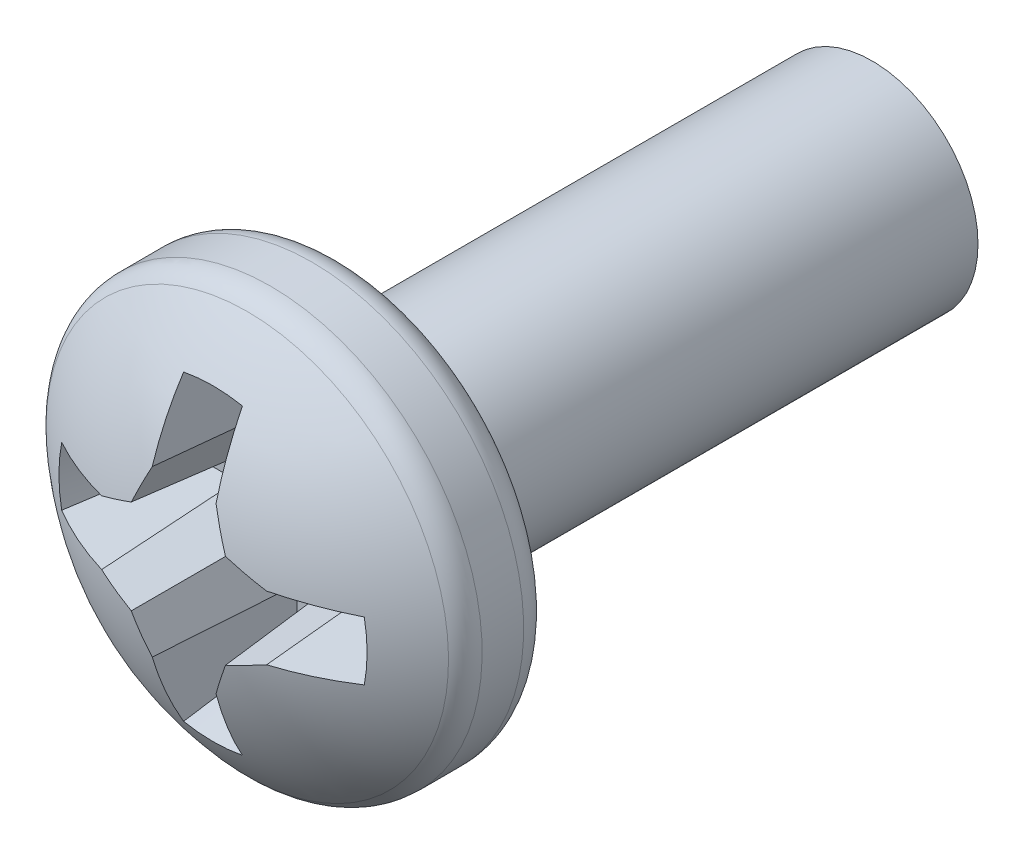
ISO-10303-21;
HEADER;
FILE_DESCRIPTION(('STEP AP214'),'2;1');
FILE_NAME('part.step','',(''),(''),'','','');
FILE_SCHEMA(('AUTOMOTIVE_DESIGN { 1 0 10303 214 1 1 1 1 }'));
ENDSEC;
DATA;
#1=APPLICATION_CONTEXT('core data for automotive mechanical design processes');
#2=APPLICATION_PROTOCOL_DEFINITION('international standard','automotive_design',2000,#1);
#3=PRODUCT_CONTEXT('',#1,'mechanical');
#4=PRODUCT('Part','Part','',(#3));
#5=PRODUCT_RELATED_PRODUCT_CATEGORY('part','',(#4));
#6=PRODUCT_DEFINITION_FORMATION('','',#4);
#7=PRODUCT_DEFINITION_CONTEXT('part definition',#1,'design');
#8=PRODUCT_DEFINITION('design','',#6,#7);
#9=PRODUCT_DEFINITION_SHAPE('','',#8);
#10=(LENGTH_UNIT() NAMED_UNIT(*) SI_UNIT(.MILLI.,.METRE.));
#11=(NAMED_UNIT(*) PLANE_ANGLE_UNIT() SI_UNIT($,.RADIAN.));
#12=(NAMED_UNIT(*) SI_UNIT($,.STERADIAN.) SOLID_ANGLE_UNIT());
#13=UNCERTAINTY_MEASURE_WITH_UNIT(LENGTH_MEASURE(1.E-05),#10,'distance_accuracy_value','');
#14=(GEOMETRIC_REPRESENTATION_CONTEXT(3) GLOBAL_UNCERTAINTY_ASSIGNED_CONTEXT((#13)) GLOBAL_UNIT_ASSIGNED_CONTEXT((#10,
#11,#12)) REPRESENTATION_CONTEXT('',''));
#15=CARTESIAN_POINT('',(0.,0.,0.));
#16=DIRECTION('',(0.,0.,1.));
#17=DIRECTION('',(1.,0.,0.));
#18=AXIS2_PLACEMENT_3D('',#15,#16,#17);
#19=CARTESIAN_POINT('',(0.,0.,3.195));
#20=DIRECTION('',(0.,0.,1.));
#21=DIRECTION('',(1.,0.,0.));
#22=AXIS2_PLACEMENT_3D('',#19,#20,#21);
#23=PLANE('',#22);
#24=DIRECTION('',(0.,1.,0.));
#25=VECTOR('',#24,1.);
#26=CARTESIAN_POINT('',(0.153325026803848,0.,3.195));
#27=LINE('',#26,#25);
#28=CARTESIAN_POINT('',(0.153325026803848,0.941513378983801,3.19499999997416));
#29=VERTEX_POINT('',#28);
#30=CARTESIAN_POINT('',(0.153325026803873,0.605770152215096,3.195));
#31=VERTEX_POINT('',#30);
#32=EDGE_CURVE('E369',#29,#31,#27,.F.);
#33=ORIENTED_EDGE('',*,*,#32,.F.);
#34=CARTESIAN_POINT('',(0.,0.,3.19499999994832));
#35=DIRECTION('',(0.,0.,1.));
#36=DIRECTION('',(1.,0.,0.));
#37=AXIS2_PLACEMENT_3D('',#34,#35,#36);
#38=CIRCLE('',#37,0.953916142350408);
#39=CARTESIAN_POINT('',(-0.153325026801598,0.941513378984166,3.19499999997416));
#40=VERTEX_POINT('',#39);
#41=EDGE_CURVE('E329',#29,#40,#38,.T.);
#42=ORIENTED_EDGE('',*,*,#41,.T.);
#43=DIRECTION('',(0.,1.,0.));
#44=VECTOR('',#43,1.);
#45=CARTESIAN_POINT('',(-0.153325026803858,0.,3.19499999999999));
#46=LINE('',#45,#44);
#47=CARTESIAN_POINT('',(-0.153325026803853,0.605770152215198,3.195));
#48=VERTEX_POINT('',#47);
#49=EDGE_CURVE('E391',#48,#40,#46,.T.);
#50=ORIENTED_EDGE('',*,*,#49,.F.);
#51=DIRECTION('',(0.382683432365053,0.923879532511302,0.));
#52=VECTOR('',#51,1.);
#53=CARTESIAN_POINT('',(-0.345043187727096,0.142921567960997,3.195));
#54=LINE('',#53,#52);
#55=CARTESIAN_POINT('',(-0.285843135922024,0.285843135922012,3.195));
#56=VERTEX_POINT('',#55);
#57=EDGE_CURVE('E400',#56,#48,#54,.T.);
#58=ORIENTED_EDGE('',*,*,#57,.F.);
#59=DIRECTION('',(0.923879532511302,0.382683432365053,0.));
#60=VECTOR('',#59,1.);
#61=CARTESIAN_POINT('',(-0.142921567960997,0.345043187727096,3.195));
#62=LINE('',#61,#60);
#63=CARTESIAN_POINT('',(-0.605770152215094,0.153325026803873,3.195));
#64=VERTEX_POINT('',#63);
#65=EDGE_CURVE('E406',#64,#56,#62,.T.);
#66=ORIENTED_EDGE('',*,*,#65,.F.);
#67=DIRECTION('',(1.,0.,0.));
#68=VECTOR('',#67,1.);
#69=CARTESIAN_POINT('',(0.,0.153325026803848,3.195));
#70=LINE('',#69,#68);
#71=CARTESIAN_POINT('',(-0.941513378984152,0.153325026801587,3.19499999997416));
#72=VERTEX_POINT('',#71);
#73=EDGE_CURVE('E411',#72,#64,#70,.T.);
#74=ORIENTED_EDGE('',*,*,#73,.F.);
#75=CARTESIAN_POINT('',(0.,0.,3.19499999994832));
#76=DIRECTION('',(0.,0.,1.));
#77=DIRECTION('',(1.,0.,0.));
#78=AXIS2_PLACEMENT_3D('',#75,#76,#77);
#79=CIRCLE('',#78,0.953916142350408);
#80=CARTESIAN_POINT('',(-0.941513378984149,-0.153325026801598,3.19499999997416));
#81=VERTEX_POINT('',#80);
#82=EDGE_CURVE('E414',#72,#81,#79,.T.);
#83=ORIENTED_EDGE('',*,*,#82,.T.);
#84=DIRECTION('',(1.,0.,0.));
#85=VECTOR('',#84,1.);
#86=CARTESIAN_POINT('',(0.,-0.153325026803858,3.19499999999999));
#87=LINE('',#86,#85);
#88=CARTESIAN_POINT('',(-0.605770152215199,-0.153325026803857,3.19499999999999));
#89=VERTEX_POINT('',#88);
#90=EDGE_CURVE('E417',#89,#81,#87,.F.);
#91=ORIENTED_EDGE('',*,*,#90,.F.);
#92=DIRECTION('',(-0.923879532511302,0.382683432365053,0.));
#93=VECTOR('',#92,1.);
#94=CARTESIAN_POINT('',(-0.142921567961001,-0.345043187727106,3.195));
#95=LINE('',#94,#93);
#96=CARTESIAN_POINT('',(-0.28584313592201,-0.285843135922032,3.195));
#97=VERTEX_POINT('',#96);
#98=EDGE_CURVE('E423',#97,#89,#95,.T.);
#99=ORIENTED_EDGE('',*,*,#98,.F.);
#100=DIRECTION('',(-0.382683432365138,0.923879532511267,0.));
#101=VECTOR('',#100,1.);
#102=CARTESIAN_POINT('',(-0.345043187727103,-0.14292156796099,3.195));
#103=LINE('',#102,#101);
#104=CARTESIAN_POINT('',(-0.153325026803813,-0.605770152215198,3.195));
#105=VERTEX_POINT('',#104);
#106=EDGE_CURVE('E429',#105,#97,#103,.T.);
#107=ORIENTED_EDGE('',*,*,#106,.F.);
#108=DIRECTION('',(0.,1.,0.));
#109=VECTOR('',#108,1.);
#110=CARTESIAN_POINT('',(-0.153325026803847,0.,3.195));
#111=LINE('',#110,#109);
#112=CARTESIAN_POINT('',(-0.153325026801587,-0.941513378984138,3.19499999997416));
#113=VERTEX_POINT('',#112);
#114=EDGE_CURVE('E435',#113,#105,#111,.T.);
#115=ORIENTED_EDGE('',*,*,#114,.F.);
#116=CARTESIAN_POINT('',(0.,0.,3.19499999994832));
#117=DIRECTION('',(0.,0.,1.));
#118=DIRECTION('',(1.,0.,0.));
#119=AXIS2_PLACEMENT_3D('',#116,#117,#118);
#120=CIRCLE('',#119,0.953916142350408);
#121=CARTESIAN_POINT('',(0.153325026801607,-0.941513378984134,3.19499999997416));
#122=VERTEX_POINT('',#121);
#123=EDGE_CURVE('E438',#113,#122,#120,.T.);
#124=ORIENTED_EDGE('',*,*,#123,.T.);
#125=DIRECTION('',(0.,1.,0.));
#126=VECTOR('',#125,1.);
#127=CARTESIAN_POINT('',(0.153325026803858,0.,3.19499999999999));
#128=LINE('',#127,#126);
#129=CARTESIAN_POINT('',(0.153325026803861,-0.605770152215199,3.19499999999999));
#130=VERTEX_POINT('',#129);
#131=EDGE_CURVE('E441',#130,#122,#128,.F.);
#132=ORIENTED_EDGE('',*,*,#131,.F.);
#133=DIRECTION('',(-0.382683432365053,-0.923879532511302,0.));
#134=VECTOR('',#133,1.);
#135=CARTESIAN_POINT('',(0.345043187727106,-0.142921567961001,3.195));
#136=LINE('',#135,#134);
#137=CARTESIAN_POINT('',(0.285843135922033,-0.285843135922014,3.195));
#138=VERTEX_POINT('',#137);
#139=EDGE_CURVE('E447',#138,#130,#136,.T.);
#140=ORIENTED_EDGE('',*,*,#139,.F.);
#141=DIRECTION('',(-0.923879532511267,-0.382683432365138,0.));
#142=VECTOR('',#141,1.);
#143=CARTESIAN_POINT('',(0.142921567960994,-0.345043187727113,3.195));
#144=LINE('',#143,#142);
#145=CARTESIAN_POINT('',(0.605770152215202,-0.153325026803821,3.195));
#146=VERTEX_POINT('',#145);
#147=EDGE_CURVE('E453',#146,#138,#144,.T.);
#148=ORIENTED_EDGE('',*,*,#147,.F.);
#149=DIRECTION('',(1.,0.,0.));
#150=VECTOR('',#149,1.);
#151=CARTESIAN_POINT('',(0.,-0.153325026803858,3.19499999999999));
#152=LINE('',#151,#150);
#153=CARTESIAN_POINT('',(0.941513378984168,-0.153325026801587,3.19499999997416));
#154=VERTEX_POINT('',#153);
#155=EDGE_CURVE('E458',#154,#146,#152,.F.);
#156=ORIENTED_EDGE('',*,*,#155,.F.);
#157=CARTESIAN_POINT('',(0.,0.,3.19499999994832));
#158=DIRECTION('',(0.,0.,1.));
#159=DIRECTION('',(1.,0.,0.));
#160=AXIS2_PLACEMENT_3D('',#157,#158,#159);
#161=CIRCLE('',#160,0.953916142350408);
#162=CARTESIAN_POINT('',(0.941513378984169,0.153325026801587,3.19499999997416));
#163=VERTEX_POINT('',#162);
#164=EDGE_CURVE('E180',#154,#163,#161,.T.);
#165=ORIENTED_EDGE('',*,*,#164,.T.);
#166=DIRECTION('',(1.,0.,0.));
#167=VECTOR('',#166,1.);
#168=CARTESIAN_POINT('',(0.,0.153325026803848,3.195));
#169=LINE('',#168,#167);
#170=CARTESIAN_POINT('',(0.605770152215199,0.153325026803846,3.195));
#171=VERTEX_POINT('',#170);
#172=EDGE_CURVE('E179',#171,#163,#169,.T.);
#173=ORIENTED_EDGE('',*,*,#172,.F.);
#174=DIRECTION('',(0.923879532511302,-0.382683432365053,0.));
#175=VECTOR('',#174,1.);
#176=CARTESIAN_POINT('',(0.142921567960997,0.345043187727097,3.19500000000001));
#177=LINE('',#176,#175);
#178=CARTESIAN_POINT('',(0.285843135921985,0.285843135922043,3.195));
#179=VERTEX_POINT('',#178);
#180=EDGE_CURVE('E371',#179,#171,#177,.T.);
#181=ORIENTED_EDGE('',*,*,#180,.F.);
#182=DIRECTION('',(0.382683432365053,-0.923879532511302,0.));
#183=VECTOR('',#182,1.);
#184=CARTESIAN_POINT('',(0.345043187727096,0.142921567960997,3.195));
#185=LINE('',#184,#183);
#186=EDGE_CURVE('E372',#31,#179,#185,.T.);
#187=ORIENTED_EDGE('',*,*,#186,.F.);
#188=EDGE_LOOP('',(#33,#42,#50,#58,#66,#74,#83,#91,#99,#107,#115,#124,#132,#140,#148,#156,#165,
#173,#181,#187));
#189=FACE_BOUND('',#188,.T.);
#190=ADVANCED_FACE('F17',(#189),#23,.T.);
#191=CARTESIAN_POINT('',(0.25,0.,4.3));
#192=DIRECTION('',(-0.996194698091745,0.,0.0871557427476639));
#193=DIRECTION('',(0.0871557427476639,0.,0.996194698091745));
#194=AXIS2_PLACEMENT_3D('',#191,#192,#193);
#195=PLANE('',#194);
#196=CARTESIAN_POINT('',(0.222202804578549,1.14347686717482,3.98227660246275));
#197=CARTESIAN_POINT('',(0.226318021238147,1.06128462666399,4.02931374411915));
#198=CARTESIAN_POINT('',(0.229966578223961,0.976837793060016,4.0710169412966));
#199=CARTESIAN_POINT('',(0.236330372848018,0.803434939665801,4.14375544669361));
#200=CARTESIAN_POINT('',(0.239045610486262,0.714478919875557,4.17479075491317));
#201=CARTESIAN_POINT('',(0.241294188450721,0.623268306992177,4.20049211865377));
#202=B_SPLINE_CURVE_WITH_KNOTS('',3,(#196,#197,#198,#199,#200,#201),.UNSPECIFIED.,.F.,.F.,(4,2,
4),(0.,0.282760723859828,0.565521447719656),.UNSPECIFIED.);
#203=CARTESIAN_POINT('',(0.222202804578726,1.14347686717304,3.98227660246477));
#204=VERTEX_POINT('',#203);
#205=CARTESIAN_POINT('',(0.241294188356618,0.623268306665479,4.20049211875669));
#206=VERTEX_POINT('',#205);
#207=EDGE_CURVE('E328',#204,#206,#202,.T.);
#208=ORIENTED_EDGE('',*,*,#207,.F.);
#209=CARTESIAN_POINT('',(0.222202804578903,1.14347686717126,3.9822766024668));
#210=CARTESIAN_POINT('',(0.210721447943668,1.10989382736518,3.85104409561942));
#211=CARTESIAN_POINT('',(0.19924095486075,1.0762720169253,3.71982145922019));
#212=CARTESIAN_POINT('',(0.176281695601464,1.00895085419717,3.45739592505391));
#213=CARTESIAN_POINT('',(0.164802929425126,0.975251501907565,3.3261930272872));
#214=CARTESIAN_POINT('',(0.153325026801134,0.941513378982835,3.19499999996898));
#215=B_SPLINE_CURVE_WITH_KNOTS('',3,(#209,#210,#211,#212,#213,#214),.UNSPECIFIED.,.F.,.F.,(4,2,
4),(0.,0.407841235605517,0.815682478248343),.UNSPECIFIED.);
#216=EDGE_CURVE('E334',#204,#29,#215,.T.);
#217=ORIENTED_EDGE('',*,*,#216,.T.);
#218=ORIENTED_EDGE('',*,*,#32,.T.);
#219=DIRECTION('',(-0.0871426484044436,-0.017333750493863,-0.996045029063885));
#220=VECTOR('',#219,1.);
#221=CARTESIAN_POINT('',(0.241294188464864,0.623268306417485,4.200492118815));
#222=LINE('',#221,#220);
#223=EDGE_CURVE('E368',#206,#31,#222,.T.);
#224=ORIENTED_EDGE('',*,*,#223,.F.);
#225=EDGE_LOOP('',(#208,#217,#218,#224));
#226=FACE_BOUND('',#225,.T.);
#227=ADVANCED_FACE('F348',(#226),#195,.T.);
#228=CARTESIAN_POINT('',(0.4343592167691,0.1799174785275,4.3));
#229=DIRECTION('',(-0.920363891963239,-0.381227206369616,0.0871557427476637));
#230=DIRECTION('',(0.382683432365053,-0.923879532511302,0.));
#231=AXIS2_PLACEMENT_3D('',#228,#229,#230);
#232=PLANE('',#231);
#233=CARTESIAN_POINT('',(0.241294188248372,0.623268306913474,4.20049211869837));
#234=CARTESIAN_POINT('',(0.26049848856184,0.579277607891633,4.2108700152784));
#235=CARTESIAN_POINT('',(0.279666825906258,0.535017269048238,4.21968871392408));
#236=CARTESIAN_POINT('',(0.317931574656992,0.445957311718337,4.23420771534672));
#237=CARTESIAN_POINT('',(0.337027986063308,0.401157693231831,4.23990801812369));
#238=CARTESIAN_POINT('',(0.356088434500573,0.356088434923769,4.24404912296629));
#239=B_SPLINE_CURVE_WITH_KNOTS('',3,(#233,#234,#235,#236,#237,#238),.UNSPECIFIED.,.F.,.F.,(4,2,
4),(0.,0.147097076014323,0.294194152028647),.UNSPECIFIED.);
#240=CARTESIAN_POINT('',(0.356088434521289,0.356088434670804,4.24404912300344));
#241=VERTEX_POINT('',#240);
#242=EDGE_CURVE('E189',#206,#241,#239,.T.);
#243=ORIENTED_EDGE('',*,*,#242,.F.);
#244=ORIENTED_EDGE('',*,*,#223,.T.);
#245=ORIENTED_EDGE('',*,*,#186,.T.);
#246=DIRECTION('',(-0.0666626913468094,-0.0666626913468493,-0.995546167269401));
#247=VECTOR('',#246,1.);
#248=CARTESIAN_POINT('',(0.356088434626304,0.35608843462641,4.244049122994));
#249=LINE('',#248,#247);
#250=EDGE_CURVE('E375',#241,#179,#249,.T.);
#251=ORIENTED_EDGE('',*,*,#250,.F.);
#252=EDGE_LOOP('',(#243,#244,#245,#251));
#253=FACE_BOUND('',#252,.T.);
#254=ADVANCED_FACE('F351',(#253),#232,.T.);
#255=CARTESIAN_POINT('',(0.1799174785275,0.4343592167691,4.3));
#256=DIRECTION('',(-0.381227206369616,-0.920363891963239,0.0871557427476637));
#257=DIRECTION('',(0.923879532511302,-0.382683432365053,0.));
#258=AXIS2_PLACEMENT_3D('',#255,#256,#257);
#259=PLANE('',#258);
#260=CARTESIAN_POINT('',(0.356088434416274,0.356088434715197,4.24404912301289));
#261=CARTESIAN_POINT('',(0.401157692725597,0.33702798627853,4.23990801818212));
#262=CARTESIAN_POINT('',(0.445957311213714,0.317931574872662,4.23420771541694));
#263=CARTESIAN_POINT('',(0.535017268547538,0.279666826122526,4.21968871401776));
#264=CARTESIAN_POINT('',(0.579277607393245,0.260498488778257,4.21087001538376));
#265=CARTESIAN_POINT('',(0.623268306417746,0.241294188464789,4.20049211881536));
#266=B_SPLINE_CURVE_WITH_KNOTS('',3,(#260,#261,#262,#263,#264,#265),.UNSPECIFIED.,.F.,.F.,(4,2,
4),(0.,0.147097076014106,0.294194152028211),.UNSPECIFIED.);
#267=CARTESIAN_POINT('',(0.623268306417743,0.241294188464842,4.20049211881517));
#268=VERTEX_POINT('',#267);
#269=EDGE_CURVE('E187',#241,#268,#266,.T.);
#270=ORIENTED_EDGE('',*,*,#269,.F.);
#271=ORIENTED_EDGE('',*,*,#250,.T.);
#272=ORIENTED_EDGE('',*,*,#180,.T.);
#273=DIRECTION('',(-0.017333750493971,-0.0871426484044451,-0.996045029063883));
#274=VECTOR('',#273,1.);
#275=CARTESIAN_POINT('',(0.6232683064177,0.241294188464828,4.20049211881501));
#276=LINE('',#275,#274);
#277=EDGE_CURVE('E181',#268,#171,#276,.T.);
#278=ORIENTED_EDGE('',*,*,#277,.F.);
#279=EDGE_LOOP('',(#270,#271,#272,#278));
#280=FACE_BOUND('',#279,.T.);
#281=ADVANCED_FACE('F209',(#280),#259,.T.);
#282=CARTESIAN_POINT('',(0.,0.25,4.3));
#283=DIRECTION('',(0.,-0.996194698091745,0.0871557427476639));
#284=DIRECTION('',(0.,-0.0871557427476639,-0.996194698091745));
#285=AXIS2_PLACEMENT_3D('',#282,#283,#284);
#286=PLANE('',#285);
#287=CARTESIAN_POINT('',(0.623268306417785,0.241294188464857,4.20049211881534));
#288=CARTESIAN_POINT('',(0.714478919405004,0.239045610500059,4.17479075507086));
#289=CARTESIAN_POINT('',(0.803434939295034,0.236330372860468,4.14375544683591));
#290=CARTESIAN_POINT('',(0.976837792880713,0.229966578231698,4.07101694138505));
#291=CARTESIAN_POINT('',(1.06128462657636,0.22631802124252,4.02931374416914));
#292=CARTESIAN_POINT('',(1.14347686717482,0.222202804578548,3.98227660246275));
#293=B_SPLINE_CURVE_WITH_KNOTS('',3,(#287,#288,#289,#290,#291,#292),.UNSPECIFIED.,.F.,.F.,(4,2,
4),(0.,0.282760724157686,0.565521448315372),.UNSPECIFIED.);
#294=CARTESIAN_POINT('',(1.14347686717184,0.2222028045791,3.98227660246905));
#295=VERTEX_POINT('',#294);
#296=EDGE_CURVE('E171',#268,#295,#293,.T.);
#297=ORIENTED_EDGE('',*,*,#296,.F.);
#298=ORIENTED_EDGE('',*,*,#277,.T.);
#299=ORIENTED_EDGE('',*,*,#172,.T.);
#300=CARTESIAN_POINT('',(0.941513378982756,0.153325026801107,3.19499999996867));
#301=CARTESIAN_POINT('',(0.975251501907498,0.164802929425103,3.32619302728695));
#302=CARTESIAN_POINT('',(1.00895085419711,0.176281695601446,3.4573959250537));
#303=CARTESIAN_POINT('',(1.07627201692528,0.199240954860741,3.71982145922008));
#304=CARTESIAN_POINT('',(1.10989382736516,0.210721447943664,3.85104409561937));
#305=CARTESIAN_POINT('',(1.14347686717126,0.222202804578903,3.9822766024668));
#306=B_SPLINE_CURVE_WITH_KNOTS('',3,(#300,#301,#302,#303,#304,#305),.UNSPECIFIED.,.F.,.F.,(4,2,
4),(0.,0.407841242642985,0.815682478248662),.UNSPECIFIED.);
#307=EDGE_CURVE('E163',#163,#295,#306,.T.);
#308=ORIENTED_EDGE('',*,*,#307,.T.);
#309=EDGE_LOOP('',(#297,#298,#299,#308));
#310=FACE_BOUND('',#309,.T.);
#311=ADVANCED_FACE('F176',(#310),#286,.T.);
#312=CARTESIAN_POINT('',(0.,0.,3.9822766024713));
#313=DIRECTION('',(0.,0.,1.));
#314=DIRECTION('',(1.,0.,0.));
#315=AXIS2_PLACEMENT_3D('',#312,#313,#314);
#316=CONICAL_SURFACE('',#315,1.16486627220524,0.261799387785978);
#317=CARTESIAN_POINT('',(1.14347686717052,-0.222202804578639,3.9822766024639));
#318=CARTESIAN_POINT('',(1.10989382736544,-0.210721447943749,3.85104409562043));
#319=CARTESIAN_POINT('',(1.07627201692657,-0.199240954861174,3.71982145922511));
#320=CARTESIAN_POINT('',(1.00895085420044,-0.176281695602576,3.45739592506665));
#321=CARTESIAN_POINT('',(0.975251501911844,-0.164802929426582,3.32619302730386));
#322=CARTESIAN_POINT('',(0.941513378988125,-0.153325026802933,3.19499999998955));
#323=B_SPLINE_CURVE_WITH_KNOTS('',3,(#317,#318,#319,#320,#321,#322),.UNSPECIFIED.,.F.,.F.,(4,2,
4),(0.,0.407841235593357,0.815682478224023),.UNSPECIFIED.);
#324=CARTESIAN_POINT('',(1.14347686717369,-0.222202804578538,3.98227660246274));
#325=VERTEX_POINT('',#324);
#326=EDGE_CURVE('E165',#325,#154,#323,.T.);
#327=ORIENTED_EDGE('',*,*,#326,.F.);
#328=CARTESIAN_POINT('',(0.,0.,3.9822766024713));
#329=DIRECTION('',(0.,0.,1.));
#330=DIRECTION('',(1.,0.,0.));
#331=AXIS2_PLACEMENT_3D('',#328,#329,#330);
#332=CIRCLE('',#331,1.16486627220524);
#333=EDGE_CURVE('E159',#295,#325,#332,.F.);
#334=ORIENTED_EDGE('',*,*,#333,.F.);
#335=ORIENTED_EDGE('',*,*,#307,.F.);
#336=ORIENTED_EDGE('',*,*,#164,.F.);
#337=EDGE_LOOP('',(#327,#334,#335,#336));
#338=FACE_BOUND('',#337,.T.);
#339=ADVANCED_FACE('F161',(#338),#316,.F.);
#340=CARTESIAN_POINT('',(0.,-0.25,4.3));
#341=DIRECTION('',(0.,0.996194698091746,0.087155742747654));
#342=DIRECTION('',(0.,-0.087155742747654,0.996194698091746));
#343=AXIS2_PLACEMENT_3D('',#340,#341,#342);
#344=PLANE('',#343);
#345=CARTESIAN_POINT('',(1.14347686717686,-0.222202804578437,3.98227660246159));
#346=CARTESIAN_POINT('',(1.06128462657808,-0.226318021242435,4.02931374416827));
#347=CARTESIAN_POINT('',(0.976837792882078,-0.229966578231636,4.07101694138443));
#348=CARTESIAN_POINT('',(0.803434939295656,-0.236330372860442,4.1437554468357));
#349=CARTESIAN_POINT('',(0.714478919405233,-0.239045610500048,4.17479075507081));
#350=CARTESIAN_POINT('',(0.623268306417597,-0.241294188464856,4.20049211881539));
#351=B_SPLINE_CURVE_WITH_KNOTS('',3,(#345,#346,#347,#348,#349,#350),.UNSPECIFIED.,.F.,.F.,(4,2,
4),(0.,0.282760724158956,0.565521448317913),.UNSPECIFIED.);
#352=CARTESIAN_POINT('',(0.623268306417517,-0.241294188464822,4.20049211881521));
#353=VERTEX_POINT('',#352);
#354=EDGE_CURVE('E170',#325,#353,#351,.T.);
#355=ORIENTED_EDGE('',*,*,#354,.F.);
#356=ORIENTED_EDGE('',*,*,#326,.T.);
#357=ORIENTED_EDGE('',*,*,#155,.T.);
#358=DIRECTION('',(-0.0173337504937389,0.0871426484044822,-0.996045029063884));
#359=VECTOR('',#358,1.);
#360=CARTESIAN_POINT('',(0.623268306417468,-0.241294188464824,4.20049211881501));
#361=LINE('',#360,#359);
#362=EDGE_CURVE('E450',#353,#146,#361,.T.);
#363=ORIENTED_EDGE('',*,*,#362,.F.);
#364=EDGE_LOOP('',(#355,#356,#357,#363));
#365=FACE_BOUND('',#364,.T.);
#366=ADVANCED_FACE('F473',(#365),#344,.T.);
#367=CARTESIAN_POINT('',(0.1799174785275,-0.4343592167691,4.3));
#368=DIRECTION('',(-0.381227206369702,0.920363891963205,0.0871557427476505));
#369=DIRECTION('',(-0.923879532511267,-0.382683432365138,0.));
#370=AXIS2_PLACEMENT_3D('',#367,#368,#369);
#371=PLANE('',#370);
#372=CARTESIAN_POINT('',(0.623268306417566,-0.24129418846482,4.2004921188154));
#373=CARTESIAN_POINT('',(0.579277607475582,-0.260498488742273,4.21087001536436));
#374=CARTESIAN_POINT('',(0.535017268713227,-0.279666826050733,4.21968871398476));
#375=CARTESIAN_POINT('',(0.445957311547775,-0.317931574729672,4.23420771536847));
#376=CARTESIAN_POINT('',(0.401157693144679,-0.33702798610015,4.23990801813178));
#377=CARTESIAN_POINT('',(0.356088434921212,-0.356088434501636,4.24404912296654));
#378=B_SPLINE_CURVE_WITH_KNOTS('',3,(#372,#373,#374,#375,#376,#377),.UNSPECIFIED.,.F.,.F.,(4,2,
4),(0.,0.147097075739058,0.294194151478116),.UNSPECIFIED.);
#379=CARTESIAN_POINT('',(0.356088434670458,-0.356088434522106,4.24404912300337));
#380=VERTEX_POINT('',#379);
#381=EDGE_CURVE('E476',#353,#380,#378,.T.);
#382=ORIENTED_EDGE('',*,*,#381,.F.);
#383=ORIENTED_EDGE('',*,*,#362,.T.);
#384=ORIENTED_EDGE('',*,*,#147,.T.);
#385=DIRECTION('',(-0.0666626913468542,0.066662691346772,-0.995546167269403));
#386=VECTOR('',#385,1.);
#387=CARTESIAN_POINT('',(0.356088434626411,-0.356088434626305,4.244049122994));
#388=LINE('',#387,#386);
#389=EDGE_CURVE('E444',#380,#138,#388,.T.);
#390=ORIENTED_EDGE('',*,*,#389,.F.);
#391=EDGE_LOOP('',(#382,#383,#384,#390));
#392=FACE_BOUND('',#391,.T.);
#393=ADVANCED_FACE('F489',(#392),#371,.T.);
#394=CARTESIAN_POINT('',(0.4343592167691,-0.1799174785275,4.3));
#395=DIRECTION('',(-0.92036389196324,0.381227206369617,0.0871557427476538));
#396=DIRECTION('',(-0.382683432365053,-0.923879532511302,0.));
#397=AXIS2_PLACEMENT_3D('',#394,#395,#396);
#398=PLANE('',#397);
#399=CARTESIAN_POINT('',(0.356088434714506,-0.356088434417908,4.24404912301274));
#400=CARTESIAN_POINT('',(0.337027986316546,-0.401157692635704,4.23990801819036));
#401=CARTESIAN_POINT('',(0.31793157494945,-0.445957311033572,4.23420771543986));
#402=CARTESIAN_POINT('',(0.279666826276989,-0.535017268189456,4.21968871408259));
#403=CARTESIAN_POINT('',(0.260498488971623,-0.579277606947472,4.21087001547583));
#404=CARTESIAN_POINT('',(0.241294188697122,-0.623268305885561,4.20049211894095));
#405=B_SPLINE_CURVE_WITH_KNOTS('',3,(#399,#400,#401,#402,#403,#404),.UNSPECIFIED.,.F.,.F.,(4,2,
4),(0.,0.147097075716313,0.294194151432626),.UNSPECIFIED.);
#406=CARTESIAN_POINT('',(0.24129418847139,-0.623268306151868,4.20049211888993));
#407=VERTEX_POINT('',#406);
#408=EDGE_CURVE('E477',#380,#407,#405,.T.);
#409=ORIENTED_EDGE('',*,*,#408,.F.);
#410=ORIENTED_EDGE('',*,*,#389,.T.);
#411=ORIENTED_EDGE('',*,*,#139,.T.);
#412=DIRECTION('',(-0.0871426484044356,0.0173337504937726,-0.996045029063888));
#413=VECTOR('',#412,1.);
#414=CARTESIAN_POINT('',(0.241294188464835,-0.6232683064175,4.20049211881501));
#415=LINE('',#414,#413);
#416=EDGE_CURVE('E443',#407,#130,#415,.T.);
#417=ORIENTED_EDGE('',*,*,#416,.F.);
#418=EDGE_LOOP('',(#409,#410,#411,#417));
#419=FACE_BOUND('',#418,.T.);
#420=ADVANCED_FACE('F609',(#419),#398,.T.);
#421=CARTESIAN_POINT('',(0.25,0.,4.3));
#422=DIRECTION('',(-0.996194698091746,0.,0.087155742747654));
#423=DIRECTION('',(0.087155742747654,0.,0.996194698091746));
#424=AXIS2_PLACEMENT_3D('',#421,#422,#423);
#425=PLANE('',#424);
#426=CARTESIAN_POINT('',(0.241294188477944,-0.623268305886235,4.20049211896485));
#427=CARTESIAN_POINT('',(0.239045610512835,-0.714478918969547,4.1747907552168));
#428=CARTESIAN_POINT('',(0.236330372871999,-0.803434938951917,4.1437554469676));
#429=CARTESIAN_POINT('',(0.229966578238872,-0.976837792714777,4.07101694146691));
#430=CARTESIAN_POINT('',(0.226318021246582,-1.06128462649527,4.02931374421541));
#431=CARTESIAN_POINT('',(0.222202804578564,-1.14347686717482,3.98227660246276));
#432=B_SPLINE_CURVE_WITH_KNOTS('',3,(#426,#427,#428,#429,#430,#431),.UNSPECIFIED.,.F.,.F.,(4,2,
4),(0.,0.282760724433322,0.565521448866643),.UNSPECIFIED.);
#433=CARTESIAN_POINT('',(0.222202804579115,-1.14347686717181,3.98227660246905));
#434=VERTEX_POINT('',#433);
#435=EDGE_CURVE('E596',#407,#434,#432,.T.);
#436=ORIENTED_EDGE('',*,*,#435,.F.);
#437=ORIENTED_EDGE('',*,*,#416,.T.);
#438=ORIENTED_EDGE('',*,*,#131,.T.);
#439=CARTESIAN_POINT('',(0.153325026801154,-0.941513378982801,3.19499999996898));
#440=CARTESIAN_POINT('',(0.164802929425145,-0.97525150190753,3.3261930272872));
#441=CARTESIAN_POINT('',(0.176281695601482,-1.00895085419713,3.45739592505391));
#442=CARTESIAN_POINT('',(0.199240954860767,-1.07627201692527,3.71982145922019));
#443=CARTESIAN_POINT('',(0.210721447943684,-1.10989382736514,3.85104409561943));
#444=CARTESIAN_POINT('',(0.222202804578918,-1.14347686717123,3.9822766024668));
#445=B_SPLINE_CURVE_WITH_KNOTS('',3,(#439,#440,#441,#442,#443,#444),.UNSPECIFIED.,.F.,.F.,(4,2,
4),(0.,0.40784124264283,0.815682478248352),.UNSPECIFIED.);
#446=EDGE_CURVE('E497',#122,#434,#445,.T.);
#447=ORIENTED_EDGE('',*,*,#446,.T.);
#448=EDGE_LOOP('',(#436,#437,#438,#447));
#449=FACE_BOUND('',#448,.T.);
#450=ADVANCED_FACE('F506',(#449),#425,.T.);
#451=CARTESIAN_POINT('',(0.,0.,3.9822766024713));
#452=DIRECTION('',(0.,0.,1.));
#453=DIRECTION('',(1.,0.,0.));
#454=AXIS2_PLACEMENT_3D('',#451,#452,#453);
#455=CONICAL_SURFACE('',#454,1.16486627220524,0.261799387785978);
#456=CARTESIAN_POINT('',(-0.222202804578649,-1.14347686717049,3.9822766024639));
#457=CARTESIAN_POINT('',(-0.210721447943757,-1.1098938273654,3.85104409562044));
#458=CARTESIAN_POINT('',(-0.19924095486118,-1.07627201692653,3.71982145922511));
#459=CARTESIAN_POINT('',(-0.176281695602578,-1.00895085420041,3.45739592506664));
#460=CARTESIAN_POINT('',(-0.164802929426582,-0.975251501911811,3.32619302730385));
#461=CARTESIAN_POINT('',(-0.153325026802932,-0.941513378988092,3.19499999998953));
#462=B_SPLINE_CURVE_WITH_KNOTS('',3,(#456,#457,#458,#459,#460,#461),.UNSPECIFIED.,.F.,.F.,(4,2,
4),(0.,0.407841235593368,0.815682478224045),.UNSPECIFIED.);
#463=CARTESIAN_POINT('',(-0.222202804578548,-1.14347686717367,3.98227660246275));
#464=VERTEX_POINT('',#463);
#465=EDGE_CURVE('E432',#464,#113,#462,.T.);
#466=ORIENTED_EDGE('',*,*,#465,.F.);
#467=CARTESIAN_POINT('',(0.,0.,3.9822766024713));
#468=DIRECTION('',(0.,0.,1.));
#469=DIRECTION('',(1.,0.,0.));
#470=AXIS2_PLACEMENT_3D('',#467,#468,#469);
#471=CIRCLE('',#470,1.16486627220524);
#472=EDGE_CURVE('E595',#434,#464,#471,.F.);
#473=ORIENTED_EDGE('',*,*,#472,.F.);
#474=ORIENTED_EDGE('',*,*,#446,.F.);
#475=ORIENTED_EDGE('',*,*,#123,.F.);
#476=EDGE_LOOP('',(#466,#473,#474,#475));
#477=FACE_BOUND('',#476,.T.);
#478=ADVANCED_FACE('F508',(#477),#455,.F.);
#479=CARTESIAN_POINT('',(-0.25,0.,4.3));
#480=DIRECTION('',(0.996194698091745,0.,0.0871557427476639));
#481=DIRECTION('',(0.0871557427476639,0.,-0.996194698091745));
#482=AXIS2_PLACEMENT_3D('',#479,#480,#481);
#483=PLANE('',#482);
#484=CARTESIAN_POINT('',(-0.222202804578447,-1.14347686717686,3.98227660246159));
#485=CARTESIAN_POINT('',(-0.226318021238071,-1.06128462666571,4.02931374411828));
#486=CARTESIAN_POINT('',(-0.229966578223906,-0.976837793061408,4.07101694129598));
#487=CARTESIAN_POINT('',(-0.236330372847998,-0.803434939666485,4.14375544669338));
#488=CARTESIAN_POINT('',(-0.239045610486256,-0.714478919875865,4.17479075491309));
#489=CARTESIAN_POINT('',(-0.241294188450724,-0.623268306992087,4.2004921186538));
#490=B_SPLINE_CURVE_WITH_KNOTS('',3,(#484,#485,#486,#487,#488,#489),.UNSPECIFIED.,.F.,.F.,(4,2,
4),(0.,0.282760723861045,0.56552144772209),.UNSPECIFIED.);
#491=CARTESIAN_POINT('',(-0.241294188356612,-0.623268306665381,4.2004921187567));
#492=VERTEX_POINT('',#491);
#493=EDGE_CURVE('E591',#464,#492,#490,.T.);
#494=ORIENTED_EDGE('',*,*,#493,.F.);
#495=ORIENTED_EDGE('',*,*,#465,.T.);
#496=ORIENTED_EDGE('',*,*,#114,.T.);
#497=DIRECTION('',(0.0871426484045262,0.0173337504936582,-0.996045029063882));
#498=VECTOR('',#497,1.);
#499=CARTESIAN_POINT('',(-0.241294188464858,-0.623268306417383,4.200492118815));
#500=LINE('',#499,#498);
#501=EDGE_CURVE('E426',#492,#105,#500,.T.);
#502=ORIENTED_EDGE('',*,*,#501,.F.);
#503=EDGE_LOOP('',(#494,#495,#496,#502));
#504=FACE_BOUND('',#503,.T.);
#505=ADVANCED_FACE('F512',(#504),#483,.T.);
#506=CARTESIAN_POINT('',(-0.4343592167691,-0.1799174785275,4.3));
#507=DIRECTION('',(0.920363891963204,0.381227206369702,0.0871557427476604));
#508=DIRECTION('',(-0.382683432365138,0.923879532511267,0.));
#509=AXIS2_PLACEMENT_3D('',#506,#507,#508);
#510=PLANE('',#509);
#511=CARTESIAN_POINT('',(-0.241294188248367,-0.62326830691338,4.2004921186984));
#512=CARTESIAN_POINT('',(-0.260498488561833,-0.579277607891553,4.21087001527843));
#513=CARTESIAN_POINT('',(-0.279666825906249,-0.535017269048172,4.2196887139241));
#514=CARTESIAN_POINT('',(-0.317931574656979,-0.4459573117183,4.23420771534673));
#515=CARTESIAN_POINT('',(-0.337027986063293,-0.401157693231809,4.2399080181237));
#516=CARTESIAN_POINT('',(-0.356088434500557,-0.356088434923763,4.2440491229663));
#517=B_SPLINE_CURVE_WITH_KNOTS('',3,(#511,#512,#513,#514,#515,#516),.UNSPECIFIED.,.F.,.F.,(4,2,
4),(0.,0.147097076014279,0.294194152028558),.UNSPECIFIED.);
#518=CARTESIAN_POINT('',(-0.356088434521288,-0.356088434670805,4.24404912300345));
#519=VERTEX_POINT('',#518);
#520=EDGE_CURVE('E568',#492,#519,#517,.T.);
#521=ORIENTED_EDGE('',*,*,#520,.F.);
#522=ORIENTED_EDGE('',*,*,#501,.T.);
#523=ORIENTED_EDGE('',*,*,#106,.T.);
#524=DIRECTION('',(0.066662691346772,0.0666626913468542,-0.995546167269403));
#525=VECTOR('',#524,1.);
#526=CARTESIAN_POINT('',(-0.356088434626305,-0.356088434626411,4.244049122994));
#527=LINE('',#526,#525);
#528=EDGE_CURVE('E420',#519,#97,#527,.T.);
#529=ORIENTED_EDGE('',*,*,#528,.F.);
#530=EDGE_LOOP('',(#521,#522,#523,#529));
#531=FACE_BOUND('',#530,.T.);
#532=ADVANCED_FACE('F576',(#531),#510,.T.);
#533=CARTESIAN_POINT('',(-0.1799174785275,-0.4343592167691,4.3));
#534=DIRECTION('',(0.381227206369617,0.92036389196324,0.0871557427476538));
#535=DIRECTION('',(-0.923879532511302,0.382683432365053,0.));
#536=AXIS2_PLACEMENT_3D('',#533,#534,#535);
#537=PLANE('',#536);
#538=CARTESIAN_POINT('',(-0.356088434416272,-0.356088434715198,4.24404912301289));
#539=CARTESIAN_POINT('',(-0.401157692725568,-0.337027986278543,4.23990801818212));
#540=CARTESIAN_POINT('',(-0.445957311213658,-0.317931574872687,4.23420771541695));
#541=CARTESIAN_POINT('',(-0.53501726854743,-0.279666826122574,4.21968871401778));
#542=CARTESIAN_POINT('',(-0.579277607393111,-0.260498488778317,4.21087001538379));
#543=CARTESIAN_POINT('',(-0.623268306417587,-0.241294188464859,4.2004921188154));
#544=B_SPLINE_CURVE_WITH_KNOTS('',3,(#538,#539,#540,#541,#542,#543),.UNSPECIFIED.,.F.,.F.,(4,2,
4),(0.,0.147097076014018,0.294194152028035),.UNSPECIFIED.);
#545=CARTESIAN_POINT('',(-0.623268306417553,-0.241294188464846,4.2004921188152));
#546=VERTEX_POINT('',#545);
#547=EDGE_CURVE('E562',#519,#546,#544,.T.);
#548=ORIENTED_EDGE('',*,*,#547,.F.);
#549=ORIENTED_EDGE('',*,*,#528,.T.);
#550=ORIENTED_EDGE('',*,*,#98,.T.);
#551=DIRECTION('',(0.0173337504937726,0.0871426484044355,-0.996045029063888));
#552=VECTOR('',#551,1.);
#553=CARTESIAN_POINT('',(-0.6232683064175,-0.241294188464829,4.20049211881501));
#554=LINE('',#553,#552);
#555=EDGE_CURVE('E419',#546,#89,#554,.T.);
#556=ORIENTED_EDGE('',*,*,#555,.F.);
#557=EDGE_LOOP('',(#548,#549,#550,#556));
#558=FACE_BOUND('',#557,.T.);
#559=ADVANCED_FACE('F573',(#558),#537,.T.);
#560=CARTESIAN_POINT('',(0.,-0.25,4.3));
#561=DIRECTION('',(0.,0.996194698091746,0.087155742747654));
#562=DIRECTION('',(0.,-0.087155742747654,0.996194698091746));
#563=AXIS2_PLACEMENT_3D('',#560,#561,#562);
#564=PLANE('',#563);
#565=CARTESIAN_POINT('',(-0.623268306417606,-0.241294188464863,4.20049211881539));
#566=CARTESIAN_POINT('',(-0.714478919404856,-0.239045610500065,4.17479075507092));
#567=CARTESIAN_POINT('',(-0.803434939294916,-0.236330372860474,4.14375544683596));
#568=CARTESIAN_POINT('',(-0.976837792880653,-0.229966578231703,4.07101694138508));
#569=CARTESIAN_POINT('',(-1.06128462657633,-0.226318021242525,4.02931374416916));
#570=CARTESIAN_POINT('',(-1.14347686717482,-0.222202804578552,3.98227660246276));
#571=B_SPLINE_CURVE_WITH_KNOTS('',3,(#565,#566,#567,#568,#569,#570),.UNSPECIFIED.,.F.,.F.,(4,2,
4),(0.,0.282760724157776,0.565521448315552),.UNSPECIFIED.);
#572=CARTESIAN_POINT('',(-1.14347686717182,-0.222202804579103,3.98227660246905));
#573=VERTEX_POINT('',#572);
#574=EDGE_CURVE('E556',#546,#573,#571,.T.);
#575=ORIENTED_EDGE('',*,*,#574,.F.);
#576=ORIENTED_EDGE('',*,*,#555,.T.);
#577=ORIENTED_EDGE('',*,*,#90,.T.);
#578=CARTESIAN_POINT('',(-0.941513378982816,-0.153325026801144,3.19499999996898));
#579=CARTESIAN_POINT('',(-0.975251501907546,-0.164802929425135,3.3261930272872));
#580=CARTESIAN_POINT('',(-1.00895085419715,-0.176281695601472,3.4573959250539));
#581=CARTESIAN_POINT('',(-1.07627201692529,-0.199240954860756,3.71982145922019));
#582=CARTESIAN_POINT('',(-1.10989382736516,-0.210721447943673,3.85104409561943));
#583=CARTESIAN_POINT('',(-1.14347686717125,-0.222202804578906,3.9822766024668));
#584=B_SPLINE_CURVE_WITH_KNOTS('',3,(#578,#579,#580,#581,#582,#583),.UNSPECIFIED.,.F.,.F.,(4,2,
4),(0.,0.407841242642829,0.81568247824835),.UNSPECIFIED.);
#585=EDGE_CURVE('E522',#81,#573,#584,.T.);
#586=ORIENTED_EDGE('',*,*,#585,.T.);
#587=EDGE_LOOP('',(#575,#576,#577,#586));
#588=FACE_BOUND('',#587,.T.);
#589=ADVANCED_FACE('F527',(#588),#564,.T.);
#590=CARTESIAN_POINT('',(0.,0.,3.9822766024713));
#591=DIRECTION('',(0.,0.,1.));
#592=DIRECTION('',(1.,0.,0.));
#593=AXIS2_PLACEMENT_3D('',#590,#591,#592);
#594=CONICAL_SURFACE('',#593,1.16486627220524,0.261799387785978);
#595=ORIENTED_EDGE('',*,*,#82,.F.);
#596=CARTESIAN_POINT('',(-1.1434768671705,0.222202804578649,3.9822766024639));
#597=CARTESIAN_POINT('',(-1.10989382736542,0.210721447943757,3.85104409562043));
#598=CARTESIAN_POINT('',(-1.07627201692655,0.19924095486118,3.71982145922511));
#599=CARTESIAN_POINT('',(-1.00895085420042,0.176281695602578,3.45739592506664));
#600=CARTESIAN_POINT('',(-0.975251501911825,0.164802929426582,3.32619302730385));
#601=CARTESIAN_POINT('',(-0.941513378988107,0.153325026802932,3.19499999998954));
#602=B_SPLINE_CURVE_WITH_KNOTS('',3,(#596,#597,#598,#599,#600,#601),.UNSPECIFIED.,.F.,.F.,(4,2,
4),(0.,0.407841235593364,0.815682478224036),.UNSPECIFIED.);
#603=CARTESIAN_POINT('',(-1.14347686717368,0.222202804578548,3.98227660246274));
#604=VERTEX_POINT('',#603);
#605=EDGE_CURVE('E341',#604,#72,#602,.T.);
#606=ORIENTED_EDGE('',*,*,#605,.F.);
#607=CARTESIAN_POINT('',(0.,0.,3.9822766024713));
#608=DIRECTION('',(0.,0.,1.));
#609=DIRECTION('',(1.,0.,0.));
#610=AXIS2_PLACEMENT_3D('',#607,#608,#609);
#611=CIRCLE('',#610,1.16486627220524);
#612=EDGE_CURVE('E550',#573,#604,#611,.F.);
#613=ORIENTED_EDGE('',*,*,#612,.F.);
#614=ORIENTED_EDGE('',*,*,#585,.F.);
#615=EDGE_LOOP('',(#595,#606,#613,#614));
#616=FACE_BOUND('',#615,.T.);
#617=ADVANCED_FACE('F530',(#616),#594,.F.);
#618=CARTESIAN_POINT('',(0.,0.25,4.3));
#619=DIRECTION('',(0.,-0.996194698091745,0.0871557427476639));
#620=DIRECTION('',(0.,-0.0871557427476639,-0.996194698091745));
#621=AXIS2_PLACEMENT_3D('',#618,#619,#620);
#622=PLANE('',#621);
#623=CARTESIAN_POINT('',(-1.14347686717686,0.222202804578446,3.98227660246159));
#624=CARTESIAN_POINT('',(-1.06128462657809,0.226318021242444,4.02931374416827));
#625=CARTESIAN_POINT('',(-0.976837792882102,0.229966578231643,4.07101694138442));
#626=CARTESIAN_POINT('',(-0.803434939295713,0.236330372860448,4.14375544683568));
#627=CARTESIAN_POINT('',(-0.714478919405307,0.239045610500052,4.17479075507078));
#628=CARTESIAN_POINT('',(-0.623268306417689,0.241294188464859,4.20049211881536));
#629=B_SPLINE_CURVE_WITH_KNOTS('',3,(#623,#624,#625,#626,#627,#628),.UNSPECIFIED.,.F.,.F.,(4,2,
4),(0.,0.282760724158906,0.565521448317811),.UNSPECIFIED.);
#630=CARTESIAN_POINT('',(-0.623268306417616,0.241294188464827,4.20049211881519));
#631=VERTEX_POINT('',#630);
#632=EDGE_CURVE('E543',#604,#631,#629,.T.);
#633=ORIENTED_EDGE('',*,*,#632,.F.);
#634=ORIENTED_EDGE('',*,*,#605,.T.);
#635=ORIENTED_EDGE('',*,*,#73,.T.);
#636=DIRECTION('',(0.0173337504939476,-0.0871426484044087,-0.996045029063887));
#637=VECTOR('',#636,1.);
#638=CARTESIAN_POINT('',(-0.62326830641757,0.241294188464828,4.20049211881501));
#639=LINE('',#638,#637);
#640=EDGE_CURVE('E403',#631,#64,#639,.T.);
#641=ORIENTED_EDGE('',*,*,#640,.F.);
#642=EDGE_LOOP('',(#633,#634,#635,#641));
#643=FACE_BOUND('',#642,.T.);
#644=ADVANCED_FACE('F533',(#643),#622,.T.);
#645=CARTESIAN_POINT('',(-0.1799174785275,0.4343592167691,4.3));
#646=DIRECTION('',(0.381227206369616,-0.920363891963239,0.0871557427476637));
#647=DIRECTION('',(0.923879532511302,0.382683432365053,0.));
#648=AXIS2_PLACEMENT_3D('',#645,#646,#647);
#649=PLANE('',#648);
#650=CARTESIAN_POINT('',(-0.623268306417662,0.241294188464826,4.20049211881537));
#651=CARTESIAN_POINT('',(-0.579277607475663,0.260498488742279,4.21087001536434));
#652=CARTESIAN_POINT('',(-0.535017268713293,0.279666826050742,4.21968871398475));
#653=CARTESIAN_POINT('',(-0.445957311547811,0.317931574729684,4.23420771536846));
#654=CARTESIAN_POINT('',(-0.4011576931447,0.337027986100164,4.23990801813177));
#655=CARTESIAN_POINT('',(-0.356088434921218,0.356088434501652,4.24404912296653));
#656=B_SPLINE_CURVE_WITH_KNOTS('',3,(#650,#651,#652,#653,#654,#655),.UNSPECIFIED.,.F.,.F.,(4,2,
4),(0.,0.147097075739102,0.294194151478204),.UNSPECIFIED.);
#657=CARTESIAN_POINT('',(-0.356088434670458,0.356088434522107,4.24404912300337));
#658=VERTEX_POINT('',#657);
#659=EDGE_CURVE('E549',#631,#658,#656,.T.);
#660=ORIENTED_EDGE('',*,*,#659,.F.);
#661=ORIENTED_EDGE('',*,*,#640,.T.);
#662=ORIENTED_EDGE('',*,*,#65,.T.);
#663=DIRECTION('',(0.0666626913468635,-0.0666626913467757,-0.995546167269403));
#664=VECTOR('',#663,1.);
#665=CARTESIAN_POINT('',(-0.35608843462641,0.356088434626304,4.244049122994));
#666=LINE('',#665,#664);
#667=EDGE_CURVE('E394',#658,#56,#666,.T.);
#668=ORIENTED_EDGE('',*,*,#667,.F.);
#669=EDGE_LOOP('',(#660,#661,#662,#668));
#670=FACE_BOUND('',#669,.T.);
#671=ADVANCED_FACE('F538',(#670),#649,.T.);
#672=CARTESIAN_POINT('',(-0.4343592167691,0.1799174785275,4.3));
#673=DIRECTION('',(0.920363891963239,-0.381227206369616,0.0871557427476637));
#674=DIRECTION('',(0.382683432365053,0.923879532511302,0.));
#675=AXIS2_PLACEMENT_3D('',#672,#673,#674);
#676=PLANE('',#675);
#677=CARTESIAN_POINT('',(-0.356088434714505,0.35608843441791,4.24404912301274));
#678=CARTESIAN_POINT('',(-0.337027986316533,0.401157692635732,4.23990801819035));
#679=CARTESIAN_POINT('',(-0.317931574949425,0.445957311033628,4.23420771543984));
#680=CARTESIAN_POINT('',(-0.279666826276941,0.535017268189565,4.21968871408257));
#681=CARTESIAN_POINT('',(-0.260498488971563,0.579277606947606,4.2108700154758));
#682=CARTESIAN_POINT('',(-0.24129418869705,0.62326830588572,4.2004921189409));
#683=B_SPLINE_CURVE_WITH_KNOTS('',3,(#677,#678,#679,#680,#681,#682),.UNSPECIFIED.,.F.,.F.,(4,2,
4),(0.,0.147097075716402,0.294194151432803),.UNSPECIFIED.);
#684=CARTESIAN_POINT('',(-0.241294188471381,0.623268306152057,4.2004921188899));
#685=VERTEX_POINT('',#684);
#686=EDGE_CURVE('E306',#658,#685,#683,.T.);
#687=ORIENTED_EDGE('',*,*,#686,.F.);
#688=ORIENTED_EDGE('',*,*,#667,.T.);
#689=ORIENTED_EDGE('',*,*,#57,.T.);
#690=DIRECTION('',(0.0871426484044352,-0.0173337504939708,-0.996045029063884));
#691=VECTOR('',#690,1.);
#692=CARTESIAN_POINT('',(-0.241294188464829,0.6232683064177,4.20049211881501));
#693=LINE('',#692,#691);
#694=EDGE_CURVE('E340',#685,#48,#693,.T.);
#695=ORIENTED_EDGE('',*,*,#694,.F.);
#696=EDGE_LOOP('',(#687,#688,#689,#695));
#697=FACE_BOUND('',#696,.T.);
#698=ADVANCED_FACE('F315',(#697),#676,.T.);
#699=CARTESIAN_POINT('',(-0.25,0.,4.3));
#700=DIRECTION('',(0.996194698091746,0.,0.087155742747654));
#701=DIRECTION('',(0.087155742747654,0.,-0.996194698091746));
#702=AXIS2_PLACEMENT_3D('',#699,#700,#701);
#703=PLANE('',#702);
#704=CARTESIAN_POINT('',(-0.241294188477934,0.623268305886414,4.2004921189648));
#705=CARTESIAN_POINT('',(-0.239045610512823,0.714478918969694,4.17479075521675));
#706=CARTESIAN_POINT('',(-0.236330372871986,0.803434938952035,4.14375544696755));
#707=CARTESIAN_POINT('',(-0.229966578238859,0.976837792714837,4.07101694146687));
#708=CARTESIAN_POINT('',(-0.226318021246568,1.0612846264953,4.02931374421538));
#709=CARTESIAN_POINT('',(-0.222202804578551,1.14347686717482,3.98227660246275));
#710=B_SPLINE_CURVE_WITH_KNOTS('',3,(#704,#705,#706,#707,#708,#709),.UNSPECIFIED.,.F.,.F.,(4,2,
4),(0.,0.282760724433233,0.565521448866467),.UNSPECIFIED.);
#711=CARTESIAN_POINT('',(-0.222202804579103,1.14347686717184,3.98227660246905));
#712=VERTEX_POINT('',#711);
#713=EDGE_CURVE('E300',#685,#712,#710,.T.);
#714=ORIENTED_EDGE('',*,*,#713,.F.);
#715=ORIENTED_EDGE('',*,*,#694,.T.);
#716=ORIENTED_EDGE('',*,*,#49,.T.);
#717=CARTESIAN_POINT('',(-0.153325026801117,0.941513378982753,3.19499999996867));
#718=CARTESIAN_POINT('',(-0.164802929425113,0.975251501907496,3.32619302728694));
#719=CARTESIAN_POINT('',(-0.176281695601454,1.00895085419711,3.4573959250537));
#720=CARTESIAN_POINT('',(-0.199240954860746,1.07627201692528,3.71982145922008));
#721=CARTESIAN_POINT('',(-0.210721447943668,1.10989382736516,3.85104409561937));
#722=CARTESIAN_POINT('',(-0.222202804578906,1.14347686717126,3.9822766024668));
#723=B_SPLINE_CURVE_WITH_KNOTS('',3,(#717,#718,#719,#720,#721,#722),.UNSPECIFIED.,.F.,.F.,(4,2,
4),(0.,0.407841242642987,0.815682478248666),.UNSPECIFIED.);
#724=EDGE_CURVE('E322',#40,#712,#723,.T.);
#725=ORIENTED_EDGE('',*,*,#724,.T.);
#726=EDGE_LOOP('',(#714,#715,#716,#725));
#727=FACE_BOUND('',#726,.T.);
#728=ADVANCED_FACE('F312',(#727),#703,.T.);
#729=CARTESIAN_POINT('',(0.,0.,3.9822766024713));
#730=DIRECTION('',(0.,0.,1.));
#731=DIRECTION('',(1.,0.,0.));
#732=AXIS2_PLACEMENT_3D('',#729,#730,#731);
#733=CONICAL_SURFACE('',#732,1.16486627220524,0.261799387785978);
#734=ORIENTED_EDGE('',*,*,#41,.F.);
#735=ORIENTED_EDGE('',*,*,#216,.F.);
#736=CARTESIAN_POINT('',(0.,0.,3.9822766024713));
#737=DIRECTION('',(0.,0.,1.));
#738=DIRECTION('',(1.,0.,0.));
#739=AXIS2_PLACEMENT_3D('',#736,#737,#738);
#740=CIRCLE('',#739,1.16486627220524);
#741=EDGE_CURVE('E298',#712,#204,#740,.F.);
#742=ORIENTED_EDGE('',*,*,#741,.F.);
#743=ORIENTED_EDGE('',*,*,#724,.F.);
#744=EDGE_LOOP('',(#734,#735,#742,#743));
#745=FACE_BOUND('',#744,.T.);
#746=ADVANCED_FACE('F277',(#745),#733,.F.);
#747=CARTESIAN_POINT('',(0.,0.,2.005769230769));
#748=DIRECTION('',(0.,-1.,0.));
#749=DIRECTION('',(0.,0.,1.));
#750=AXIS2_PLACEMENT_3D('',#747,#748,#749);
#751=SPHERICAL_SURFACE('',#750,2.294230769231);
#752=CARTESIAN_POINT('',(0.,0.,3.72320880379921));
#753=DIRECTION('',(0.,0.,-1.));
#754=DIRECTION('',(0.,1.,0.));
#755=AXIS2_PLACEMENT_3D('',#752,#753,#754);
#756=CIRCLE('',#755,1.52114960982717);
#757=CARTESIAN_POINT('',(0.,1.52114960982716,3.72320880379921));
#758=VERTEX_POINT('',#757);
#759=EDGE_CURVE('E295',#758,#758,#756,.T.);
#760=ORIENTED_EDGE('',*,*,#759,.F.);
#761=EDGE_LOOP('',(#760));
#762=FACE_BOUND('',#761,.T.);
#763=ORIENTED_EDGE('',*,*,#713,.T.);
#764=ORIENTED_EDGE('',*,*,#741,.T.);
#765=ORIENTED_EDGE('',*,*,#207,.T.);
#766=ORIENTED_EDGE('',*,*,#242,.T.);
#767=ORIENTED_EDGE('',*,*,#269,.T.);
#768=ORIENTED_EDGE('',*,*,#296,.T.);
#769=ORIENTED_EDGE('',*,*,#333,.T.);
#770=ORIENTED_EDGE('',*,*,#354,.T.);
#771=ORIENTED_EDGE('',*,*,#381,.T.);
#772=ORIENTED_EDGE('',*,*,#408,.T.);
#773=ORIENTED_EDGE('',*,*,#435,.T.);
#774=ORIENTED_EDGE('',*,*,#472,.T.);
#775=ORIENTED_EDGE('',*,*,#493,.T.);
#776=ORIENTED_EDGE('',*,*,#520,.T.);
#777=ORIENTED_EDGE('',*,*,#547,.T.);
#778=ORIENTED_EDGE('',*,*,#574,.T.);
#779=ORIENTED_EDGE('',*,*,#612,.T.);
#780=ORIENTED_EDGE('',*,*,#632,.T.);
#781=ORIENTED_EDGE('',*,*,#659,.T.);
#782=ORIENTED_EDGE('',*,*,#686,.T.);
#783=EDGE_LOOP('',(#763,#764,#765,#766,#767,#768,#769,#770,#771,#772,#773,#774,#775,#776,#777,
#778,#779,#780,#781,#782));
#784=FACE_BOUND('',#783,.T.);
#785=ADVANCED_FACE('F184',(#762,#784),#751,.T.);
#786=CARTESIAN_POINT('',(0.,0.,3.548038604934));
#787=DIRECTION('',(0.,0.,-1.));
#788=DIRECTION('',(0.,1.,0.));
#789=AXIS2_PLACEMENT_3D('',#786,#787,#788);
#790=TOROIDAL_SURFACE('',#789,1.366,0.234);
#791=CARTESIAN_POINT('',(0.,0.,3.548038604934));
#792=DIRECTION('',(0.,0.,-1.));
#793=DIRECTION('',(-1.,0.,0.));
#794=AXIS2_PLACEMENT_3D('',#791,#792,#793);
#795=CIRCLE('',#794,1.6);
#796=CARTESIAN_POINT('',(-1.6,0.,3.548038604934));
#797=VERTEX_POINT('',#796);
#798=EDGE_CURVE('E265',#797,#797,#795,.T.);
#799=ORIENTED_EDGE('',*,*,#798,.F.);
#800=EDGE_LOOP('',(#799));
#801=FACE_BOUND('',#800,.T.);
#802=ORIENTED_EDGE('',*,*,#759,.T.);
#803=EDGE_LOOP('',(#802));
#804=FACE_BOUND('',#803,.T.);
#805=ADVANCED_FACE('F268',(#801,#804),#790,.T.);
#806=CARTESIAN_POINT('',(0.,0.,0.));
#807=DIRECTION('',(0.,0.,-1.));
#808=DIRECTION('',(-1.,0.,0.));
#809=AXIS2_PLACEMENT_3D('',#806,#807,#808);
#810=CYLINDRICAL_SURFACE('',#809,1.6);
#811=CARTESIAN_POINT('',(0.,0.,3.234));
#812=DIRECTION('',(0.,0.,-1.));
#813=DIRECTION('',(0.,1.,0.));
#814=AXIS2_PLACEMENT_3D('',#811,#812,#813);
#815=CIRCLE('',#814,1.6);
#816=CARTESIAN_POINT('',(0.,1.59999999999999,3.234));
#817=VERTEX_POINT('',#816);
#818=EDGE_CURVE('E225',#817,#817,#815,.T.);
#819=ORIENTED_EDGE('',*,*,#818,.F.);
#820=EDGE_LOOP('',(#819));
#821=FACE_BOUND('',#820,.T.);
#822=ORIENTED_EDGE('',*,*,#798,.T.);
#823=EDGE_LOOP('',(#822));
#824=FACE_BOUND('',#823,.T.);
#825=ADVANCED_FACE('F252',(#821,#824),#810,.T.);
#826=CARTESIAN_POINT('',(0.,0.,3.234));
#827=DIRECTION('',(0.,0.,-1.));
#828=DIRECTION('',(0.,1.,0.));
#829=AXIS2_PLACEMENT_3D('',#826,#827,#828);
#830=TOROIDAL_SURFACE('',#829,1.366,0.234);
#831=CARTESIAN_POINT('',(0.,0.,3.));
#832=DIRECTION('',(0.,0.,1.));
#833=DIRECTION('',(0.,1.,0.));
#834=AXIS2_PLACEMENT_3D('',#831,#832,#833);
#835=CIRCLE('',#834,1.36600000000001);
#836=CARTESIAN_POINT('',(0.,-1.36600000000001,3.));
#837=VERTEX_POINT('',#836);
#838=CARTESIAN_POINT('',(0.,1.36599999999999,3.));
#839=VERTEX_POINT('',#838);
#840=EDGE_CURVE('E220',#837,#839,#835,.F.);
#841=ORIENTED_EDGE('',*,*,#840,.F.);
#842=CARTESIAN_POINT('',(0.,0.,3.));
#843=DIRECTION('',(0.,0.,1.));
#844=DIRECTION('',(0.,-1.,0.));
#845=AXIS2_PLACEMENT_3D('',#842,#843,#844);
#846=CIRCLE('',#845,1.36599999999999);
#847=EDGE_CURVE('E36',#839,#837,#846,.F.);
#848=ORIENTED_EDGE('',*,*,#847,.F.);
#849=EDGE_LOOP('',(#841,#848));
#850=FACE_BOUND('',#849,.T.);
#851=ORIENTED_EDGE('',*,*,#818,.T.);
#852=EDGE_LOOP('',(#851));
#853=FACE_BOUND('',#852,.T.);
#854=ADVANCED_FACE('F221',(#850,#853),#830,.T.);
#855=CARTESIAN_POINT('',(0.,0.,3.));
#856=DIRECTION('',(0.,0.,-1.));
#857=DIRECTION('',(-1.,0.,0.));
#858=AXIS2_PLACEMENT_3D('',#855,#856,#857);
#859=PLANE('',#858);
#860=CARTESIAN_POINT('',(0.,0.,3.));
#861=DIRECTION('',(0.,0.,1.));
#862=DIRECTION('',(1.,0.,0.));
#863=AXIS2_PLACEMENT_3D('',#860,#861,#862);
#864=CIRCLE('',#863,0.8);
#865=CARTESIAN_POINT('',(0.8,0.,3.));
#866=VERTEX_POINT('',#865);
#867=EDGE_CURVE('E28',#866,#866,#864,.F.);
#868=ORIENTED_EDGE('',*,*,#867,.F.);
#869=EDGE_LOOP('',(#868));
#870=FACE_BOUND('',#869,.T.);
#871=ORIENTED_EDGE('',*,*,#840,.T.);
#872=ORIENTED_EDGE('',*,*,#847,.T.);
#873=EDGE_LOOP('',(#871,#872));
#874=FACE_BOUND('',#873,.T.);
#875=ADVANCED_FACE('F227',(#870,#874),#859,.T.);
#876=CARTESIAN_POINT('',(0.,0.,-1.));
#877=DIRECTION('',(0.,0.,-1.));
#878=DIRECTION('',(-1.,0.,0.));
#879=AXIS2_PLACEMENT_3D('',#876,#877,#878);
#880=PLANE('',#879);
#881=CARTESIAN_POINT('',(0.,0.,-1.));
#882=DIRECTION('',(0.,0.,1.));
#883=DIRECTION('',(1.,0.,0.));
#884=AXIS2_PLACEMENT_3D('',#881,#882,#883);
#885=CIRCLE('',#884,0.8);
#886=CARTESIAN_POINT('',(0.8,0.,-1.));
#887=VERTEX_POINT('',#886);
#888=EDGE_CURVE('E11',#887,#887,#885,.T.);
#889=ORIENTED_EDGE('',*,*,#888,.F.);
#890=EDGE_LOOP('',(#889));
#891=FACE_BOUND('',#890,.T.);
#892=ADVANCED_FACE('F245',(#891),#880,.T.);
#893=CARTESIAN_POINT('',(0.,0.,0.));
#894=DIRECTION('',(0.,0.,1.));
#895=DIRECTION('',(1.,0.,0.));
#896=AXIS2_PLACEMENT_3D('',#893,#894,#895);
#897=CYLINDRICAL_SURFACE('',#896,0.8);
#898=ORIENTED_EDGE('',*,*,#888,.T.);
#899=EDGE_LOOP('',(#898));
#900=FACE_BOUND('',#899,.T.);
#901=ORIENTED_EDGE('',*,*,#867,.T.);
#902=EDGE_LOOP('',(#901));
#903=FACE_BOUND('',#902,.T.);
#904=ADVANCED_FACE('F281',(#900,#903),#897,.T.);
#905=CLOSED_SHELL('',(#190,#227,#254,#281,#311,#339,#366,#393,#420,#450,#478,#505,#532,#559,
#589,#617,#644,#671,#698,#728,#746,#785,#805,#825,#854,#875,#892,#904));
#906=MANIFOLD_SOLID_BREP('B1',#905);
#907=ADVANCED_BREP_SHAPE_REPRESENTATION('',(#18,#906),#14);
#908=SHAPE_DEFINITION_REPRESENTATION(#9,#907);
ENDSEC;
END-ISO-10303-21;
